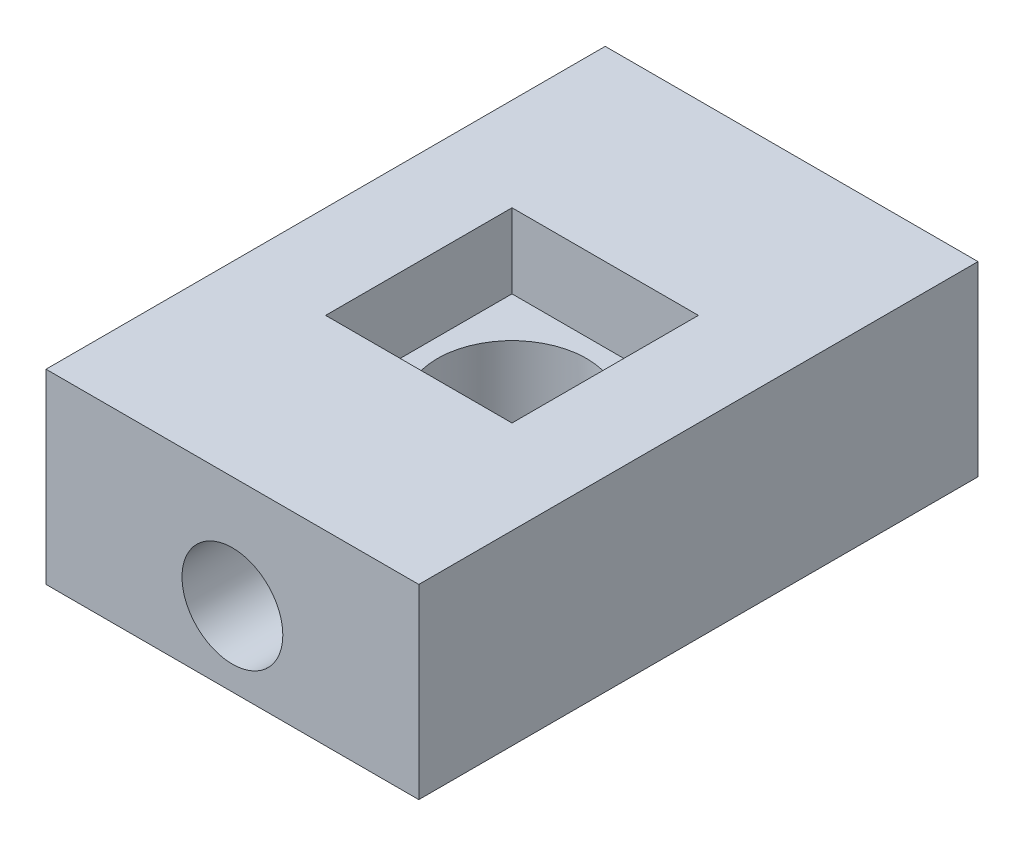
ISO-10303-21;
HEADER;
FILE_DESCRIPTION(('STEP AP214'),'2;1');
FILE_NAME('part.step','',(''),(''),'','','');
FILE_SCHEMA(('AUTOMOTIVE_DESIGN { 1 0 10303 214 1 1 1 1 }'));
ENDSEC;
DATA;
#1=APPLICATION_CONTEXT('core data for automotive mechanical design processes');
#2=APPLICATION_PROTOCOL_DEFINITION('international standard','automotive_design',2000,#1);
#3=PRODUCT_CONTEXT('',#1,'mechanical');
#4=PRODUCT('Part','Part','',(#3));
#5=PRODUCT_RELATED_PRODUCT_CATEGORY('part','',(#4));
#6=PRODUCT_DEFINITION_FORMATION('','',#4);
#7=PRODUCT_DEFINITION_CONTEXT('part definition',#1,'design');
#8=PRODUCT_DEFINITION('design','',#6,#7);
#9=PRODUCT_DEFINITION_SHAPE('','',#8);
#10=(LENGTH_UNIT() NAMED_UNIT(*) SI_UNIT(.MILLI.,.METRE.));
#11=(NAMED_UNIT(*) PLANE_ANGLE_UNIT() SI_UNIT($,.RADIAN.));
#12=(NAMED_UNIT(*) SI_UNIT($,.STERADIAN.) SOLID_ANGLE_UNIT());
#13=UNCERTAINTY_MEASURE_WITH_UNIT(LENGTH_MEASURE(1.E-05),#10,'distance_accuracy_value','');
#14=(GEOMETRIC_REPRESENTATION_CONTEXT(3) GLOBAL_UNCERTAINTY_ASSIGNED_CONTEXT((#13)) GLOBAL_UNIT_ASSIGNED_CONTEXT((#10,
#11,#12)) REPRESENTATION_CONTEXT('',''));
#15=CARTESIAN_POINT('',(0.,0.,0.));
#16=DIRECTION('',(0.,0.,1.));
#17=DIRECTION('',(1.,0.,0.));
#18=AXIS2_PLACEMENT_3D('',#15,#16,#17);
#19=CARTESIAN_POINT('',(-10.,10.,-15.));
#20=DIRECTION('',(1.,0.,0.));
#21=DIRECTION('',(0.,0.,-1.));
#22=AXIS2_PLACEMENT_3D('',#19,#20,#21);
#23=PLANE('',#22);
#24=DIRECTION('',(0.,0.,1.));
#25=VECTOR('',#24,1.);
#26=CARTESIAN_POINT('',(-10.,0.,-15.));
#27=LINE('',#26,#25);
#28=CARTESIAN_POINT('',(-10.,0.,-15.));
#29=VERTEX_POINT('',#28);
#30=CARTESIAN_POINT('',(-10.,0.,15.));
#31=VERTEX_POINT('',#30);
#32=EDGE_CURVE('E156',#29,#31,#27,.T.);
#33=ORIENTED_EDGE('',*,*,#32,.T.);
#34=DIRECTION('',(0.,-1.,0.));
#35=VECTOR('',#34,1.);
#36=CARTESIAN_POINT('',(-10.,10.,15.));
#37=LINE('',#36,#35);
#38=CARTESIAN_POINT('',(-10.,10.,15.));
#39=VERTEX_POINT('',#38);
#40=EDGE_CURVE('E11',#39,#31,#37,.T.);
#41=ORIENTED_EDGE('',*,*,#40,.F.);
#42=DIRECTION('',(0.,0.,1.));
#43=VECTOR('',#42,1.);
#44=CARTESIAN_POINT('',(-10.,10.,-15.));
#45=LINE('',#44,#43);
#46=CARTESIAN_POINT('',(-10.,10.,-15.));
#47=VERTEX_POINT('',#46);
#48=EDGE_CURVE('E157',#47,#39,#45,.T.);
#49=ORIENTED_EDGE('',*,*,#48,.F.);
#50=DIRECTION('',(0.,-1.,0.));
#51=VECTOR('',#50,1.);
#52=CARTESIAN_POINT('',(-10.,10.,-15.));
#53=LINE('',#52,#51);
#54=EDGE_CURVE('E163',#47,#29,#53,.T.);
#55=ORIENTED_EDGE('',*,*,#54,.T.);
#56=EDGE_LOOP('',(#33,#41,#49,#55));
#57=FACE_BOUND('',#56,.T.);
#58=ADVANCED_FACE('F37',(#57),#23,.F.);
#59=CARTESIAN_POINT('',(10.,10.,15.));
#60=DIRECTION('',(0.,0.,-1.));
#61=DIRECTION('',(-1.,0.,0.));
#62=AXIS2_PLACEMENT_3D('',#59,#60,#61);
#63=PLANE('',#62);
#64=CARTESIAN_POINT('',(0.,4.,15.));
#65=DIRECTION('',(0.,0.,1.));
#66=DIRECTION('',(1.,0.,0.));
#67=AXIS2_PLACEMENT_3D('',#64,#65,#66);
#68=CIRCLE('',#67,2.7051);
#69=CARTESIAN_POINT('',(2.7051,4.,15.));
#70=VERTEX_POINT('',#69);
#71=EDGE_CURVE('E210',#70,#70,#68,.T.);
#72=ORIENTED_EDGE('',*,*,#71,.F.);
#73=EDGE_LOOP('',(#72));
#74=FACE_BOUND('',#73,.T.);
#75=DIRECTION('',(1.,0.,0.));
#76=VECTOR('',#75,1.);
#77=CARTESIAN_POINT('',(10.,0.,15.));
#78=LINE('',#77,#76);
#79=CARTESIAN_POINT('',(10.,0.,15.));
#80=VERTEX_POINT('',#79);
#81=EDGE_CURVE('E166',#31,#80,#78,.T.);
#82=ORIENTED_EDGE('',*,*,#81,.T.);
#83=DIRECTION('',(0.,-1.,0.));
#84=VECTOR('',#83,1.);
#85=CARTESIAN_POINT('',(10.,10.,15.));
#86=LINE('',#85,#84);
#87=CARTESIAN_POINT('',(10.,10.,15.));
#88=VERTEX_POINT('',#87);
#89=EDGE_CURVE('E45',#88,#80,#86,.T.);
#90=ORIENTED_EDGE('',*,*,#89,.F.);
#91=DIRECTION('',(1.,0.,0.));
#92=VECTOR('',#91,1.);
#93=CARTESIAN_POINT('',(10.,10.,15.));
#94=LINE('',#93,#92);
#95=EDGE_CURVE('E89',#39,#88,#94,.T.);
#96=ORIENTED_EDGE('',*,*,#95,.F.);
#97=ORIENTED_EDGE('',*,*,#40,.T.);
#98=EDGE_LOOP('',(#82,#90,#96,#97));
#99=FACE_BOUND('',#98,.T.);
#100=ADVANCED_FACE('F197',(#74,#99),#63,.F.);
#101=CARTESIAN_POINT('',(10.,10.,-15.));
#102=DIRECTION('',(-1.,0.,0.));
#103=DIRECTION('',(0.,0.,1.));
#104=AXIS2_PLACEMENT_3D('',#101,#102,#103);
#105=PLANE('',#104);
#106=DIRECTION('',(0.,0.,-1.));
#107=VECTOR('',#106,1.);
#108=CARTESIAN_POINT('',(10.,0.,-15.));
#109=LINE('',#108,#107);
#110=CARTESIAN_POINT('',(10.,0.,-15.));
#111=VERTEX_POINT('',#110);
#112=EDGE_CURVE('E168',#80,#111,#109,.T.);
#113=ORIENTED_EDGE('',*,*,#112,.T.);
#114=DIRECTION('',(0.,-1.,0.));
#115=VECTOR('',#114,1.);
#116=CARTESIAN_POINT('',(10.,10.,-15.));
#117=LINE('',#116,#115);
#118=CARTESIAN_POINT('',(10.,10.,-15.));
#119=VERTEX_POINT('',#118);
#120=EDGE_CURVE('E172',#119,#111,#117,.T.);
#121=ORIENTED_EDGE('',*,*,#120,.F.);
#122=DIRECTION('',(0.,0.,-1.));
#123=VECTOR('',#122,1.);
#124=CARTESIAN_POINT('',(10.,10.,-15.));
#125=LINE('',#124,#123);
#126=EDGE_CURVE('E160',#88,#119,#125,.T.);
#127=ORIENTED_EDGE('',*,*,#126,.F.);
#128=ORIENTED_EDGE('',*,*,#89,.T.);
#129=EDGE_LOOP('',(#113,#121,#127,#128));
#130=FACE_BOUND('',#129,.T.);
#131=ADVANCED_FACE('F178',(#130),#105,.F.);
#132=CARTESIAN_POINT('',(10.,10.,-15.));
#133=DIRECTION('',(0.,0.,1.));
#134=DIRECTION('',(1.,0.,0.));
#135=AXIS2_PLACEMENT_3D('',#132,#133,#134);
#136=PLANE('',#135);
#137=CARTESIAN_POINT('',(0.,4.,-15.));
#138=DIRECTION('',(0.,0.,-1.));
#139=DIRECTION('',(-1.,0.,0.));
#140=AXIS2_PLACEMENT_3D('',#137,#138,#139);
#141=CIRCLE('',#140,2.7051);
#142=CARTESIAN_POINT('',(-2.7051,4.,-15.));
#143=VERTEX_POINT('',#142);
#144=EDGE_CURVE('E256',#143,#143,#141,.T.);
#145=ORIENTED_EDGE('',*,*,#144,.F.);
#146=EDGE_LOOP('',(#145));
#147=FACE_BOUND('',#146,.T.);
#148=DIRECTION('',(-1.,0.,0.));
#149=VECTOR('',#148,1.);
#150=CARTESIAN_POINT('',(10.,0.,-15.));
#151=LINE('',#150,#149);
#152=EDGE_CURVE('E82',#111,#29,#151,.T.);
#153=ORIENTED_EDGE('',*,*,#152,.T.);
#154=ORIENTED_EDGE('',*,*,#54,.F.);
#155=DIRECTION('',(-1.,0.,0.));
#156=VECTOR('',#155,1.);
#157=CARTESIAN_POINT('',(10.,10.,-15.));
#158=LINE('',#157,#156);
#159=EDGE_CURVE('E61',#119,#47,#158,.T.);
#160=ORIENTED_EDGE('',*,*,#159,.F.);
#161=ORIENTED_EDGE('',*,*,#120,.T.);
#162=EDGE_LOOP('',(#153,#154,#160,#161));
#163=FACE_BOUND('',#162,.T.);
#164=ADVANCED_FACE('F186',(#147,#163),#136,.F.);
#165=CARTESIAN_POINT('',(0.,10.,0.));
#166=DIRECTION('',(0.,-1.,0.));
#167=DIRECTION('',(0.,0.,-1.));
#168=AXIS2_PLACEMENT_3D('',#165,#166,#167);
#169=PLANE('',#168);
#170=DIRECTION('',(-1.,0.,0.));
#171=VECTOR('',#170,1.);
#172=CARTESIAN_POINT('',(-5.,10.,-5.));
#173=LINE('',#172,#171);
#174=CARTESIAN_POINT('',(5.,10.,-5.));
#175=VERTEX_POINT('',#174);
#176=CARTESIAN_POINT('',(-5.,10.,-5.));
#177=VERTEX_POINT('',#176);
#178=EDGE_CURVE('E144',#175,#177,#173,.T.);
#179=ORIENTED_EDGE('',*,*,#178,.F.);
#180=DIRECTION('',(0.,0.,-1.));
#181=VECTOR('',#180,1.);
#182=CARTESIAN_POINT('',(5.,10.,-5.));
#183=LINE('',#182,#181);
#184=CARTESIAN_POINT('',(5.,10.,5.));
#185=VERTEX_POINT('',#184);
#186=EDGE_CURVE('E52',#185,#175,#183,.T.);
#187=ORIENTED_EDGE('',*,*,#186,.F.);
#188=DIRECTION('',(1.,0.,0.));
#189=VECTOR('',#188,1.);
#190=CARTESIAN_POINT('',(-5.,10.,5.));
#191=LINE('',#190,#189);
#192=CARTESIAN_POINT('',(-5.,10.,5.));
#193=VERTEX_POINT('',#192);
#194=EDGE_CURVE('E132',#193,#185,#191,.T.);
#195=ORIENTED_EDGE('',*,*,#194,.F.);
#196=DIRECTION('',(0.,0.,1.));
#197=VECTOR('',#196,1.);
#198=CARTESIAN_POINT('',(-5.,10.,-5.));
#199=LINE('',#198,#197);
#200=EDGE_CURVE('E135',#177,#193,#199,.T.);
#201=ORIENTED_EDGE('',*,*,#200,.F.);
#202=EDGE_LOOP('',(#179,#187,#195,#201));
#203=FACE_BOUND('',#202,.T.);
#204=ORIENTED_EDGE('',*,*,#48,.T.);
#205=ORIENTED_EDGE('',*,*,#95,.T.);
#206=ORIENTED_EDGE('',*,*,#126,.T.);
#207=ORIENTED_EDGE('',*,*,#159,.T.);
#208=EDGE_LOOP('',(#204,#205,#206,#207));
#209=FACE_BOUND('',#208,.T.);
#210=ADVANCED_FACE('F188',(#203,#209),#169,.F.);
#211=CARTESIAN_POINT('',(0.,0.,0.));
#212=DIRECTION('',(0.,-1.,0.));
#213=DIRECTION('',(0.,0.,-1.));
#214=AXIS2_PLACEMENT_3D('',#211,#212,#213);
#215=PLANE('',#214);
#216=ORIENTED_EDGE('',*,*,#32,.F.);
#217=ORIENTED_EDGE('',*,*,#152,.F.);
#218=ORIENTED_EDGE('',*,*,#112,.F.);
#219=ORIENTED_EDGE('',*,*,#81,.F.);
#220=EDGE_LOOP('',(#216,#217,#218,#219));
#221=FACE_BOUND('',#220,.T.);
#222=ADVANCED_FACE('F182',(#221),#215,.T.);
#223=CARTESIAN_POINT('',(0.,6.,0.));
#224=DIRECTION('',(0.,1.,0.));
#225=DIRECTION('',(0.,0.,1.));
#226=AXIS2_PLACEMENT_3D('',#223,#224,#225);
#227=PLANE('',#226);
#228=DIRECTION('',(0.,0.,-1.));
#229=VECTOR('',#228,1.);
#230=CARTESIAN_POINT('',(5.,6.,-5.));
#231=LINE('',#230,#229);
#232=CARTESIAN_POINT('',(5.,6.,5.));
#233=VERTEX_POINT('',#232);
#234=CARTESIAN_POINT('',(5.,6.,-5.));
#235=VERTEX_POINT('',#234);
#236=EDGE_CURVE('E113',#233,#235,#231,.T.);
#237=ORIENTED_EDGE('',*,*,#236,.T.);
#238=DIRECTION('',(-1.,0.,0.));
#239=VECTOR('',#238,1.);
#240=CARTESIAN_POINT('',(-5.,6.,-5.));
#241=LINE('',#240,#239);
#242=CARTESIAN_POINT('',(-5.,6.,-5.));
#243=VERTEX_POINT('',#242);
#244=EDGE_CURVE('E122',#235,#243,#241,.T.);
#245=ORIENTED_EDGE('',*,*,#244,.T.);
#246=DIRECTION('',(0.,0.,1.));
#247=VECTOR('',#246,1.);
#248=CARTESIAN_POINT('',(-5.,6.,-5.));
#249=LINE('',#248,#247);
#250=CARTESIAN_POINT('',(-5.,6.,5.));
#251=VERTEX_POINT('',#250);
#252=EDGE_CURVE('E127',#243,#251,#249,.T.);
#253=ORIENTED_EDGE('',*,*,#252,.T.);
#254=DIRECTION('',(1.,0.,0.));
#255=VECTOR('',#254,1.);
#256=CARTESIAN_POINT('',(-5.,6.,5.));
#257=LINE('',#256,#255);
#258=EDGE_CURVE('E119',#251,#233,#257,.T.);
#259=ORIENTED_EDGE('',*,*,#258,.T.);
#260=EDGE_LOOP('',(#237,#245,#253,#259));
#261=FACE_BOUND('',#260,.T.);
#262=CARTESIAN_POINT('',(0.,6.,0.));
#263=DIRECTION('',(0.,1.,0.));
#264=DIRECTION('',(0.,0.,1.));
#265=AXIS2_PLACEMENT_3D('',#262,#263,#264);
#266=CIRCLE('',#265,4.);
#267=CARTESIAN_POINT('',(0.,6.,4.));
#268=VERTEX_POINT('',#267);
#269=EDGE_CURVE('E40',#268,#268,#266,.F.);
#270=ORIENTED_EDGE('',*,*,#269,.T.);
#271=EDGE_LOOP('',(#270));
#272=FACE_BOUND('',#271,.T.);
#273=ADVANCED_FACE('F129',(#261,#272),#227,.T.);
#274=CARTESIAN_POINT('',(5.,6.,-5.));
#275=DIRECTION('',(1.,0.,0.));
#276=DIRECTION('',(0.,0.,-1.));
#277=AXIS2_PLACEMENT_3D('',#274,#275,#276);
#278=PLANE('',#277);
#279=ORIENTED_EDGE('',*,*,#186,.T.);
#280=DIRECTION('',(0.,1.,0.));
#281=VECTOR('',#280,1.);
#282=CARTESIAN_POINT('',(5.,6.,-5.));
#283=LINE('',#282,#281);
#284=EDGE_CURVE('E109',#235,#175,#283,.T.);
#285=ORIENTED_EDGE('',*,*,#284,.F.);
#286=ORIENTED_EDGE('',*,*,#236,.F.);
#287=DIRECTION('',(0.,1.,0.));
#288=VECTOR('',#287,1.);
#289=CARTESIAN_POINT('',(5.,6.,5.));
#290=LINE('',#289,#288);
#291=EDGE_CURVE('E148',#233,#185,#290,.T.);
#292=ORIENTED_EDGE('',*,*,#291,.T.);
#293=EDGE_LOOP('',(#279,#285,#286,#292));
#294=FACE_BOUND('',#293,.T.);
#295=ADVANCED_FACE('F111',(#294),#278,.F.);
#296=CARTESIAN_POINT('',(-5.,6.,5.));
#297=DIRECTION('',(0.,0.,1.));
#298=DIRECTION('',(1.,0.,0.));
#299=AXIS2_PLACEMENT_3D('',#296,#297,#298);
#300=PLANE('',#299);
#301=ORIENTED_EDGE('',*,*,#194,.T.);
#302=ORIENTED_EDGE('',*,*,#291,.F.);
#303=ORIENTED_EDGE('',*,*,#258,.F.);
#304=DIRECTION('',(0.,1.,0.));
#305=VECTOR('',#304,1.);
#306=CARTESIAN_POINT('',(-5.,6.,5.));
#307=LINE('',#306,#305);
#308=EDGE_CURVE('E150',#251,#193,#307,.T.);
#309=ORIENTED_EDGE('',*,*,#308,.T.);
#310=EDGE_LOOP('',(#301,#302,#303,#309));
#311=FACE_BOUND('',#310,.T.);
#312=ADVANCED_FACE('F284',(#311),#300,.F.);
#313=CARTESIAN_POINT('',(-5.,6.,-5.));
#314=DIRECTION('',(-1.,0.,0.));
#315=DIRECTION('',(0.,0.,1.));
#316=AXIS2_PLACEMENT_3D('',#313,#314,#315);
#317=PLANE('',#316);
#318=ORIENTED_EDGE('',*,*,#200,.T.);
#319=ORIENTED_EDGE('',*,*,#308,.F.);
#320=ORIENTED_EDGE('',*,*,#252,.F.);
#321=DIRECTION('',(0.,1.,0.));
#322=VECTOR('',#321,1.);
#323=CARTESIAN_POINT('',(-5.,6.,-5.));
#324=LINE('',#323,#322);
#325=EDGE_CURVE('E118',#243,#177,#324,.T.);
#326=ORIENTED_EDGE('',*,*,#325,.T.);
#327=EDGE_LOOP('',(#318,#319,#320,#326));
#328=FACE_BOUND('',#327,.T.);
#329=ADVANCED_FACE('F290',(#328),#317,.F.);
#330=CARTESIAN_POINT('',(-5.,6.,-5.));
#331=DIRECTION('',(0.,0.,-1.));
#332=DIRECTION('',(-1.,0.,0.));
#333=AXIS2_PLACEMENT_3D('',#330,#331,#332);
#334=PLANE('',#333);
#335=ORIENTED_EDGE('',*,*,#178,.T.);
#336=ORIENTED_EDGE('',*,*,#325,.F.);
#337=ORIENTED_EDGE('',*,*,#244,.F.);
#338=ORIENTED_EDGE('',*,*,#284,.T.);
#339=EDGE_LOOP('',(#335,#336,#337,#338));
#340=FACE_BOUND('',#339,.T.);
#341=ADVANCED_FACE('F123',(#340),#334,.F.);
#342=CARTESIAN_POINT('',(0.,2.,0.));
#343=DIRECTION('',(0.,1.,0.));
#344=DIRECTION('',(0.,0.,1.));
#345=AXIS2_PLACEMENT_3D('',#342,#343,#344);
#346=PLANE('',#345);
#347=CARTESIAN_POINT('',(0.,2.,0.));
#348=DIRECTION('',(0.,1.,0.));
#349=DIRECTION('',(0.,0.,1.));
#350=AXIS2_PLACEMENT_3D('',#347,#348,#349);
#351=CIRCLE('',#350,4.);
#352=CARTESIAN_POINT('',(0.,2.,4.));
#353=VERTEX_POINT('',#352);
#354=EDGE_CURVE('E153',#353,#353,#351,.T.);
#355=ORIENTED_EDGE('',*,*,#354,.T.);
#356=EDGE_LOOP('',(#355));
#357=FACE_BOUND('',#356,.T.);
#358=ADVANCED_FACE('F270',(#357),#346,.T.);
#359=CARTESIAN_POINT('',(0.,2.,0.));
#360=DIRECTION('',(0.,1.,0.));
#361=DIRECTION('',(0.,0.,1.));
#362=AXIS2_PLACEMENT_3D('',#359,#360,#361);
#363=CYLINDRICAL_SURFACE('',#362,4.);
#364=CARTESIAN_POINT('',(-0.499999999999991,4.,-3.96862696659689));
#365=CARTESIAN_POINT('',(-0.499998810966781,3.97203274324163,-3.96862736834266));
#366=CARTESIAN_POINT('',(-0.497645579804248,3.94404800701904,-3.96892579023789));
#367=CARTESIAN_POINT('',(-0.488295282744259,3.88885735491908,-3.97008678195994));
#368=CARTESIAN_POINT('',(-0.48129336421825,3.86165228390059,-3.97094994128592));
#369=CARTESIAN_POINT('',(-0.462855338565184,3.8088280235768,-3.97314114755085));
#370=CARTESIAN_POINT('',(-0.45142224095964,3.78320777157627,-3.9744688789073));
#371=CARTESIAN_POINT('',(-0.424452839685898,3.73425430963539,-3.97743924703982));
#372=CARTESIAN_POINT('',(-0.408917237474951,3.71092070965139,-3.97908182996857));
#373=CARTESIAN_POINT('',(-0.374090690052877,3.66706755057558,-3.9825071184878));
#374=CARTESIAN_POINT('',(-0.354781363004853,3.64656263953623,-3.98429048340409));
#375=CARTESIAN_POINT('',(-0.31299505213424,3.60907544621219,-3.98779046575166));
#376=CARTESIAN_POINT('',(-0.290517910811601,3.59209333918107,-3.98950707985877));
#377=CARTESIAN_POINT('',(-0.242941966135189,3.56208128409873,-3.99268688922565));
#378=CARTESIAN_POINT('',(-0.217834739112218,3.54906459098008,-3.99414922769361));
#379=CARTESIAN_POINT('',(-0.165769343611179,3.52743776001181,-3.99664847390905));
#380=CARTESIAN_POINT('',(-0.138811243872178,3.5188274586147,-3.99768539744594));
#381=CARTESIAN_POINT('',(-0.0839591375502199,3.50630158633312,-3.99921233741246));
#382=CARTESIAN_POINT('',(-0.0560707719326734,3.50236166429523,-3.99970518967188));
#383=CARTESIAN_POINT('',(-2.46401373079159E-05,3.4992129229927,-4.00009813945843));
#384=CARTESIAN_POINT('',(0.0281331153989552,3.5000039176095,-3.99999826030416));
#385=CARTESIAN_POINT('',(0.0837530537949097,3.50627504055149,-3.99921929554002));
#386=CARTESIAN_POINT('',(0.11121824115289,3.51172897969628,-3.99854344491145));
#387=CARTESIAN_POINT('',(0.164840432781074,3.52713023532599,-3.99669211188467));
#388=CARTESIAN_POINT('',(0.19099741217124,3.53707763723337,-3.99551661998809));
#389=CARTESIAN_POINT('',(0.241341763087726,3.56121129855676,-3.99279251561583));
#390=CARTESIAN_POINT('',(0.265523645568101,3.57540889154604,-3.99124290768648));
#391=CARTESIAN_POINT('',(0.311171490461292,3.60763167244321,-3.98794393813057));
#392=CARTESIAN_POINT('',(0.332637328243468,3.62565703589372,-3.98619456734453));
#393=CARTESIAN_POINT('',(0.372397606154585,3.66517036371968,-3.98267773504703));
#394=CARTESIAN_POINT('',(0.390669367999194,3.68668115190934,-3.98091023160946));
#395=CARTESIAN_POINT('',(0.423346570125016,3.73247631135649,-3.97756814388116));
#396=CARTESIAN_POINT('',(0.437751998287014,3.75676069130762,-3.97599356019516));
#397=CARTESIAN_POINT('',(0.462288914716541,3.80743389911247,-3.97321560522544));
#398=CARTESIAN_POINT('',(0.47241858597246,3.83382361599064,-3.97201239181626));
#399=CARTESIAN_POINT('',(0.488096330893612,3.88794789070537,-3.97011648499191));
#400=CARTESIAN_POINT('',(0.493644625359918,3.91568238366175,-3.96942376697341));
#401=CARTESIAN_POINT('',(0.499972086381716,3.97150863639995,-3.9686317775681));
#402=CARTESIAN_POINT('',(0.500783168399651,3.99959672461776,-3.96852853488475));
#403=CARTESIAN_POINT('',(0.497697390646105,4.05550838593308,-3.9689166822393));
#404=CARTESIAN_POINT('',(0.493800631221956,4.08333196465586,-3.9694080596029));
#405=CARTESIAN_POINT('',(0.481436657159539,4.13782915271557,-3.97092645696797));
#406=CARTESIAN_POINT('',(0.472984896749206,4.16450632303808,-3.97195166538932));
#407=CARTESIAN_POINT('',(0.45176674382322,4.21606483097063,-3.97442073994161));
#408=CARTESIAN_POINT('',(0.439000199716239,4.24094610544817,-3.97586462078153));
#409=CARTESIAN_POINT('',(0.409436404430979,4.28835092876259,-3.97901786270647));
#410=CARTESIAN_POINT('',(0.392618223915416,4.31086133306288,-3.98072858547417));
#411=CARTESIAN_POINT('',(0.355458148473787,4.352751310787,-3.98421847910205));
#412=CARTESIAN_POINT('',(0.335116116485093,4.37213076237359,-3.98599765262258));
#413=CARTESIAN_POINT('',(0.291346355111701,4.40732083746687,-3.98943617737392));
#414=CARTESIAN_POINT('',(0.267901698423404,4.42311048935899,-3.99109478782504));
#415=CARTESIAN_POINT('',(0.218674516336356,4.45052764352675,-3.99409422606322));
#416=CARTESIAN_POINT('',(0.192892038073663,4.46215522969619,-3.99543506025543));
#417=CARTESIAN_POINT('',(0.13979077182789,4.4808835573816,-3.99764458130637));
#418=CARTESIAN_POINT('',(0.112476313302355,4.48799641920632,-3.99851453137541));
#419=CARTESIAN_POINT('',(0.057029211455592,4.49753281784534,-3.99968950935513));
#420=CARTESIAN_POINT('',(0.028896605087622,4.49995656611984,-3.99999456274035));
#421=CARTESIAN_POINT('',(-0.0271834366687552,4.50004198445842,-4.00000525602733));
#422=CARTESIAN_POINT('',(-0.0551308275429448,4.49773599211359,-3.99971496633568));
#423=CARTESIAN_POINT('',(-0.11023754829052,4.48849587731383,-3.99857568231588));
#424=CARTESIAN_POINT('',(-0.137396878711966,4.48156175807764,-3.99772668837629));
#425=CARTESIAN_POINT('',(-0.190152288597459,4.46327237713005,-3.99556497042407));
#426=CARTESIAN_POINT('',(-0.21574891203191,4.45191866412535,-3.99425240886894));
#427=CARTESIAN_POINT('',(-0.264678667428799,4.42511573707848,-3.99130889521256));
#428=CARTESIAN_POINT('',(-0.2880117724776,4.40966647434766,-3.98967793932624));
#429=CARTESIAN_POINT('',(-0.331917353592505,4.37499135693272,-3.98626638785116));
#430=CARTESIAN_POINT('',(-0.352470757566853,4.35574144129526,-3.98448488255784));
#431=CARTESIAN_POINT('',(-0.390068223763862,4.31406141119422,-3.98098031802708));
#432=CARTESIAN_POINT('',(-0.40711145355869,4.29163054450181,-3.979257272734));
#433=CARTESIAN_POINT('',(-0.437261048503199,4.24412601546052,-3.97605762278938));
#434=CARTESIAN_POINT('',(-0.450351956633338,4.21904248201298,-3.97458199550456));
#435=CARTESIAN_POINT('',(-0.472117057668662,4.16702865188105,-3.97205571623925));
#436=CARTESIAN_POINT('',(-0.480796054245654,4.14010040013932,-3.97100460230776));
#437=CARTESIAN_POINT('',(-0.491413179247587,4.09419400259129,-3.96970157363969));
#438=CARTESIAN_POINT('',(-0.494628606202107,4.07550540969248,-3.96930060304382));
#439=CARTESIAN_POINT('',(-0.498922411181093,4.03788055000661,-3.96876316445983));
#440=CARTESIAN_POINT('',(-0.500000805419855,4.01894428509981,-3.96862669446485));
#441=CARTESIAN_POINT('',(-0.499999999999991,4.,-3.96862696659689));
#442=B_SPLINE_CURVE_WITH_KNOTS('',3,(#364,#365,#366,#367,#368,#369,#370,#371,#372,#373,#374,
#375,#376,#377,#378,#379,#380,#381,#382,#383,#384,#385,#386,#387,#388,#389,#390,#391,#392,#393,
#394,#395,#396,#397,#398,#399,#400,#401,#402,#403,#404,#405,#406,#407,#408,#409,#410,#411,#412,
#413,#414,#415,#416,#417,#418,#419,#420,#421,#422,#423,#424,#425,#426,#427,#428,#429,#430,#431,
#432,#433,#434,#435,#436,#437,#438,#439,#440,#441),.UNSPECIFIED.,.T.,.F.,(4,2,2,2,2,2,2,2,2,2,2,
2,2,2,2,2,2,2,2,2,2,2,2,2,2,2,2,2,2,2,2,2,2,2,2,2,2,2,4),(0.,0.0838325634958463,
0.167752775230474,0.251616090516236,0.33546507590122,0.419733155098125,0.50400542548515,
0.588556372291473,0.67310418067965,0.757209193882903,0.841310898340204,0.924943329866063,
1.00857735134356,1.09243640882559,1.17629931293819,1.26073539475552,1.34517174123883,
1.429643933478,1.51411205431235,1.59801043561174,1.68190702865421,1.76552075258544,
1.84913741442368,1.93319563908819,2.01725713398959,2.10179777178465,2.18633670541772,
2.27064771356985,2.35495491954559,2.43868763257647,2.52242028737354,2.60612362708814,
2.68982796192845,2.77408025778163,2.85835251087962,2.94295019540962,3.02745557196399,
3.08424197926585,3.1410279557109),.UNSPECIFIED.);
#443=CARTESIAN_POINT('',(-0.499999999999991,4.,-3.96862696659689));
#444=VERTEX_POINT('',#443);
#445=EDGE_CURVE('E249',#444,#444,#442,.T.);
#446=ORIENTED_EDGE('',*,*,#445,.F.);
#447=EDGE_LOOP('',(#446));
#448=FACE_BOUND('',#447,.T.);
#449=CARTESIAN_POINT('',(0.,3.50000000000001,4.));
#450=CARTESIAN_POINT('',(0.0279682191111518,3.50000118818715,3.99999960979286));
#451=CARTESIAN_POINT('',(0.0559539148605486,3.50235457583386,3.9997035691098));
#452=CARTESIAN_POINT('',(0.111146560417949,3.51170555091417,3.99855108022272));
#453=CARTESIAN_POINT('',(0.138352666124747,3.51870798758469,3.99769404688286));
#454=CARTESIAN_POINT('',(0.191179114962608,3.53714752878282,3.99551612208881));
#455=CARTESIAN_POINT('',(0.216800512029224,3.54858164836198,3.99419554291108));
#456=CARTESIAN_POINT('',(0.265755894978603,3.57555345679397,3.9912374017562));
#457=CARTESIAN_POINT('',(0.28909027231127,3.59109044170615,3.98959989416823));
#458=CARTESIAN_POINT('',(0.332942563386258,3.62591838996792,3.98618064261265));
#459=CARTESIAN_POINT('',(0.35344607298742,3.64522742586925,3.98439822938484));
#460=CARTESIAN_POINT('',(0.390930558711493,3.68701256470733,3.9808954520195));
#461=CARTESIAN_POINT('',(0.407911355278444,3.70948882898265,3.97917509104854));
#462=CARTESIAN_POINT('',(0.437922032256782,3.75706399551314,3.97598461123917));
#463=CARTESIAN_POINT('',(0.450938419188208,3.78217147231359,3.97451535435582));
#464=CARTESIAN_POINT('',(0.472564615315017,3.83423741038947,3.97200225691537));
#465=CARTESIAN_POINT('',(0.481174591613036,3.8611958014294,3.97095840022627));
#466=CARTESIAN_POINT('',(0.493699796004946,3.91604883911735,3.96942067920723));
#467=CARTESIAN_POINT('',(0.497639342946333,3.94393785154084,3.96892396687349));
#468=CARTESIAN_POINT('',(0.500787109911439,3.99998525269436,3.96852805628558));
#469=CARTESIAN_POINT('',(0.499995520200477,4.02814363054626,3.96862883400302));
#470=CARTESIAN_POINT('',(0.493723447289574,4.08376096544975,3.9694139107395));
#471=CARTESIAN_POINT('',(0.488269752596933,4.11122299724005,3.97009487592066));
#472=CARTESIAN_POINT('',(0.472870076636404,4.16483900424379,3.97195839951526));
#473=CARTESIAN_POINT('',(0.462924004350375,4.1909929529428,3.97314096809145));
#474=CARTESIAN_POINT('',(0.438793111982324,4.24133359980433,3.9758782317293));
#475=CARTESIAN_POINT('',(0.424596650741522,4.26551466004979,3.97743394642289));
#476=CARTESIAN_POINT('',(0.39237629389138,4.31116133888264,3.9807414228612));
#477=CARTESIAN_POINT('',(0.374352223216152,4.33262683319473,3.98249319357133));
#478=CARTESIAN_POINT('',(0.334839822150753,4.37238854214454,3.98601021978085));
#479=CARTESIAN_POINT('',(0.313328401567999,4.39066181835319,3.98777548477378));
#480=CARTESIAN_POINT('',(0.267531433822782,4.4233417760061,3.99110926511171));
#481=CARTESIAN_POINT('',(0.243245880263649,4.43774844853439,3.99267778000301));
#482=CARTESIAN_POINT('',(0.192572334272696,4.46228626409278,3.99544230443716));
#483=CARTESIAN_POINT('',(0.166183639067543,4.47241597077624,3.99663818880307));
#484=CARTESIAN_POINT('',(0.112061588086212,4.48809409870464,3.99852157156012));
#485=CARTESIAN_POINT('',(0.0843282953261343,4.4936427344274,3.99920909375174));
#486=CARTESIAN_POINT('',(0.0285026327827013,4.4999714848521,3.99999519282152));
#487=CARTESIAN_POINT('',(0.000413898039723779,4.50078319847281,4.00009767228527));
#488=CARTESIAN_POINT('',(-0.0554992072994958,4.4976984531888,3.99971267601086));
#489=CARTESIAN_POINT('',(-0.0833235835129374,4.49380209454967,3.99922521283643));
#490=CARTESIAN_POINT('',(-0.1378249015443,4.48143805824512,3.99771753751339));
#491=CARTESIAN_POINT('',(-0.164505314084936,4.47298544731947,3.99669908162774));
#492=CARTESIAN_POINT('',(-0.216069930971675,4.45176450961741,3.99424344620039));
#493=CARTESIAN_POINT('',(-0.240954074293057,4.43899603630171,3.99280625244125));
#494=CARTESIAN_POINT('',(-0.288360904137478,4.4094293724985,3.98966364582022));
#495=CARTESIAN_POINT('',(-0.310870751988757,4.39261074203887,3.98795688808502));
#496=CARTESIAN_POINT('',(-0.352759397925256,4.35545010049315,3.98447028465131));
#497=CARTESIAN_POINT('',(-0.372138071667363,4.3351079495498,3.9826904360538));
#498=CARTESIAN_POINT('',(-0.407326391763595,4.29133851664857,3.97924621092517));
#499=CARTESIAN_POINT('',(-0.423115092113578,4.26789433073792,3.97758254944265));
#500=CARTESIAN_POINT('',(-0.450530577888692,4.21866835102905,3.9745708220743));
#501=CARTESIAN_POINT('',(-0.462157446745665,4.19288660410469,3.97322274986205));
#502=CARTESIAN_POINT('',(-0.480885315773299,4.13978493617048,3.97099970078599));
#503=CARTESIAN_POINT('',(-0.487998125491412,4.1124692339904,3.97012349036958));
#504=CARTESIAN_POINT('',(-0.49753399877356,4.05701950324387,3.96893983181491));
#505=CARTESIAN_POINT('',(-0.499957280507143,4.0288855128082,3.96863235721755));
#506=CARTESIAN_POINT('',(-0.500041307216958,3.97280621415907,3.96862175396491));
#507=CARTESIAN_POINT('',(-0.497734959539846,3.94486095033362,3.96891444950391));
#508=CARTESIAN_POINT('',(-0.488494880969856,3.88975857413099,3.9700622290744));
#509=CARTESIAN_POINT('',(-0.481561149581145,3.86260146183824,3.97091731316616));
#510=CARTESIAN_POINT('',(-0.463273414737923,3.80985060864672,3.9730922315491));
#511=CARTESIAN_POINT('',(-0.451920996194178,3.78425631099564,3.97441189918557));
#512=CARTESIAN_POINT('',(-0.425121380430054,3.73533066919034,3.97736756648964));
#513=CARTESIAN_POINT('',(-0.409674131901911,3.71199935339604,3.97900357012083));
#514=CARTESIAN_POINT('',(-0.375001266253161,3.66809375493191,3.98242120950447));
#515=CARTESIAN_POINT('',(-0.355751125154985,3.64753890780901,3.98420374416807));
#516=CARTESIAN_POINT('',(-0.314070045393671,3.60993863496641,3.9877056631858));
#517=CARTESIAN_POINT('',(-0.291638357828308,3.59289403784514,3.98942503255118));
#518=CARTESIAN_POINT('',(-0.244133124170838,3.56274292857895,3.99261411317349));
#519=CARTESIAN_POINT('',(-0.21904985591923,3.54965163882016,3.9940828501566));
#520=CARTESIAN_POINT('',(-0.167036580460253,3.52788575141675,3.99659529815345));
#521=CARTESIAN_POINT('',(-0.140108616174045,3.51920635472932,3.99763947073915));
#522=CARTESIAN_POINT('',(-0.0942011543935834,3.50858813236575,3.99893344065549));
#523=CARTESIAN_POINT('',(-0.075511132703383,3.5053722116036,3.99933145179091));
#524=CARTESIAN_POINT('',(-0.0378834126424865,3.50107775086136,3.99986486265838));
#525=CARTESIAN_POINT('',(-0.0189457160992052,3.49999919512015,4.00000026432694));
#526=CARTESIAN_POINT('',(0.,3.50000000000001,4.));
#527=B_SPLINE_CURVE_WITH_KNOTS('',3,(#449,#450,#451,#452,#453,#454,#455,#456,#457,#458,#459,
#460,#461,#462,#463,#464,#465,#466,#467,#468,#469,#470,#471,#472,#473,#474,#475,#476,#477,#478,
#479,#480,#481,#482,#483,#484,#485,#486,#487,#488,#489,#490,#491,#492,#493,#494,#495,#496,#497,
#498,#499,#500,#501,#502,#503,#504,#505,#506,#507,#508,#509,#510,#511,#512,#513,#514,#515,#516,
#517,#518,#519,#520,#521,#522,#523,#524,#525,#526),.UNSPECIFIED.,.T.,.F.,(4,2,2,2,2,2,2,2,2,2,2,
2,2,2,2,2,2,2,2,2,2,2,2,2,2,2,2,2,2,2,2,2,2,2,2,2,2,2,4),(0.,0.0838354545552481,
0.167758492188683,0.25162510163635,0.335477331182141,0.419741626403679,0.504010215600013,
0.58856250063773,0.673111578993603,0.757218450572629,0.841321939769313,0.924945392883369,
1.00857054033247,1.09242685257105,1.17628700102726,1.26072695627281,1.34516710622621,
1.42963559146319,1.51410012180754,1.59800055878382,1.68189920900383,1.76552210778676,
1.84914784615787,1.93320480585681,2.01726510275014,2.10180394301511,2.18634108844304,
2.27065614856181,2.35496728602121,2.43869380240439,2.52242032775906,2.60611684941293,
2.68981441982448,2.77407047538362,2.85834639693998,2.94294280607366,3.02744699736802,
3.08423768637521,3.14102795660082),.UNSPECIFIED.);
#528=CARTESIAN_POINT('',(0.,3.50000000000001,4.));
#529=VERTEX_POINT('',#528);
#530=EDGE_CURVE('E215',#529,#529,#527,.T.);
#531=ORIENTED_EDGE('',*,*,#530,.T.);
#532=EDGE_LOOP('',(#531));
#533=FACE_BOUND('',#532,.T.);
#534=ORIENTED_EDGE('',*,*,#354,.F.);
#535=EDGE_LOOP('',(#534));
#536=FACE_BOUND('',#535,.T.);
#537=ORIENTED_EDGE('',*,*,#269,.F.);
#538=EDGE_LOOP('',(#537));
#539=FACE_BOUND('',#538,.T.);
#540=ADVANCED_FACE('F266',(#448,#533,#536,#539),#363,.F.);
#541=CARTESIAN_POINT('',(0.,4.,6.1));
#542=DIRECTION('',(0.,0.,-1.));
#543=DIRECTION('',(-1.,0.,0.));
#544=AXIS2_PLACEMENT_3D('',#541,#542,#543);
#545=PLANE('',#544);
#546=CARTESIAN_POINT('',(0.,4.,6.1));
#547=DIRECTION('',(0.,0.,-1.));
#548=DIRECTION('',(-1.,0.,0.));
#549=AXIS2_PLACEMENT_3D('',#546,#547,#548);
#550=CIRCLE('',#549,0.499999999999992);
#551=CARTESIAN_POINT('',(-0.499999999999991,4.,6.1));
#552=VERTEX_POINT('',#551);
#553=EDGE_CURVE('E212',#552,#552,#550,.T.);
#554=ORIENTED_EDGE('',*,*,#553,.T.);
#555=EDGE_LOOP('',(#554));
#556=FACE_BOUND('',#555,.T.);
#557=CARTESIAN_POINT('',(0.,4.,6.1));
#558=DIRECTION('',(0.,0.,1.));
#559=DIRECTION('',(1.,0.,0.));
#560=AXIS2_PLACEMENT_3D('',#557,#558,#559);
#561=CIRCLE('',#560,2.7051);
#562=CARTESIAN_POINT('',(2.7051,4.,6.1));
#563=VERTEX_POINT('',#562);
#564=EDGE_CURVE('E138',#563,#563,#561,.T.);
#565=ORIENTED_EDGE('',*,*,#564,.T.);
#566=EDGE_LOOP('',(#565));
#567=FACE_BOUND('',#566,.T.);
#568=ADVANCED_FACE('F269',(#556,#567),#545,.F.);
#569=CARTESIAN_POINT('',(0.,4.,15.));
#570=DIRECTION('',(0.,0.,1.));
#571=DIRECTION('',(1.,0.,0.));
#572=AXIS2_PLACEMENT_3D('',#569,#570,#571);
#573=CYLINDRICAL_SURFACE('',#572,2.7051);
#574=ORIENTED_EDGE('',*,*,#564,.F.);
#575=EDGE_LOOP('',(#574));
#576=FACE_BOUND('',#575,.T.);
#577=ORIENTED_EDGE('',*,*,#71,.T.);
#578=EDGE_LOOP('',(#577));
#579=FACE_BOUND('',#578,.T.);
#580=ADVANCED_FACE('F233',(#576,#579),#573,.F.);
#581=CARTESIAN_POINT('',(0.,4.,15.));
#582=DIRECTION('',(0.,0.,1.));
#583=DIRECTION('',(1.,0.,0.));
#584=AXIS2_PLACEMENT_3D('',#581,#582,#583);
#585=CYLINDRICAL_SURFACE('',#584,0.499999999999992);
#586=ORIENTED_EDGE('',*,*,#530,.F.);
#587=EDGE_LOOP('',(#586));
#588=FACE_BOUND('',#587,.T.);
#589=ORIENTED_EDGE('',*,*,#553,.F.);
#590=EDGE_LOOP('',(#589));
#591=FACE_BOUND('',#590,.T.);
#592=ADVANCED_FACE('F228',(#588,#591),#585,.F.);
#593=CARTESIAN_POINT('',(0.,4.,-6.1));
#594=DIRECTION('',(0.,0.,1.));
#595=DIRECTION('',(1.,0.,0.));
#596=AXIS2_PLACEMENT_3D('',#593,#594,#595);
#597=PLANE('',#596);
#598=CARTESIAN_POINT('',(0.,4.,-6.1));
#599=DIRECTION('',(0.,0.,1.));
#600=DIRECTION('',(1.,0.,0.));
#601=AXIS2_PLACEMENT_3D('',#598,#599,#600);
#602=CIRCLE('',#601,0.499999999999992);
#603=CARTESIAN_POINT('',(0.499999999999994,4.,-6.1));
#604=VERTEX_POINT('',#603);
#605=EDGE_CURVE('E254',#604,#604,#602,.T.);
#606=ORIENTED_EDGE('',*,*,#605,.T.);
#607=EDGE_LOOP('',(#606));
#608=FACE_BOUND('',#607,.T.);
#609=CARTESIAN_POINT('',(0.,4.,-6.1));
#610=DIRECTION('',(0.,0.,-1.));
#611=DIRECTION('',(-1.,0.,0.));
#612=AXIS2_PLACEMENT_3D('',#609,#610,#611);
#613=CIRCLE('',#612,2.7051);
#614=CARTESIAN_POINT('',(-2.7051,4.,-6.1));
#615=VERTEX_POINT('',#614);
#616=EDGE_CURVE('E224',#615,#615,#613,.T.);
#617=ORIENTED_EDGE('',*,*,#616,.T.);
#618=EDGE_LOOP('',(#617));
#619=FACE_BOUND('',#618,.T.);
#620=ADVANCED_FACE('F232',(#608,#619),#597,.F.);
#621=CARTESIAN_POINT('',(0.,4.,-15.));
#622=DIRECTION('',(0.,0.,-1.));
#623=DIRECTION('',(-1.,0.,0.));
#624=AXIS2_PLACEMENT_3D('',#621,#622,#623);
#625=CYLINDRICAL_SURFACE('',#624,2.7051);
#626=ORIENTED_EDGE('',*,*,#616,.F.);
#627=EDGE_LOOP('',(#626));
#628=FACE_BOUND('',#627,.T.);
#629=ORIENTED_EDGE('',*,*,#144,.T.);
#630=EDGE_LOOP('',(#629));
#631=FACE_BOUND('',#630,.T.);
#632=ADVANCED_FACE('F237',(#628,#631),#625,.F.);
#633=CARTESIAN_POINT('',(0.,4.,-15.));
#634=DIRECTION('',(0.,0.,-1.));
#635=DIRECTION('',(-1.,0.,0.));
#636=AXIS2_PLACEMENT_3D('',#633,#634,#635);
#637=CYLINDRICAL_SURFACE('',#636,0.499999999999992);
#638=ORIENTED_EDGE('',*,*,#445,.T.);
#639=EDGE_LOOP('',(#638));
#640=FACE_BOUND('',#639,.T.);
#641=ORIENTED_EDGE('',*,*,#605,.F.);
#642=EDGE_LOOP('',(#641));
#643=FACE_BOUND('',#642,.T.);
#644=ADVANCED_FACE('F241',(#640,#643),#637,.F.);
#645=CLOSED_SHELL('',(#58,#100,#131,#164,#210,#222,#273,#295,#312,#329,#341,#358,#540,#568,#580,
#592,#620,#632,#644));
#646=MANIFOLD_SOLID_BREP('B2',#645);
#647=ADVANCED_BREP_SHAPE_REPRESENTATION('',(#18,#646),#14);
#648=SHAPE_DEFINITION_REPRESENTATION(#9,#647);
ENDSEC;
END-ISO-10303-21;
